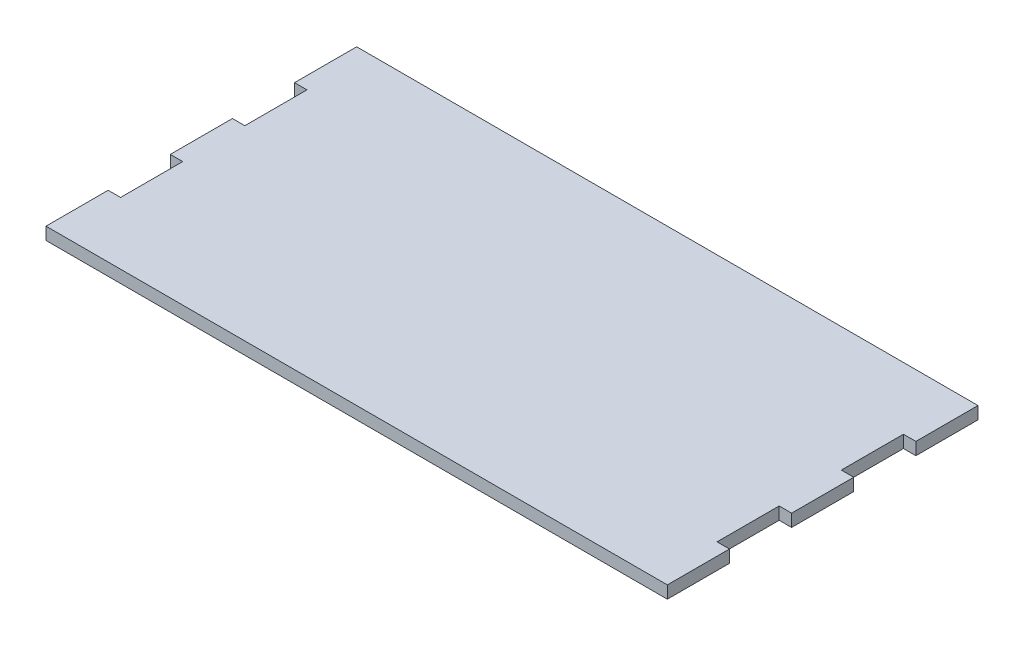
ISO-10303-21;
HEADER;
FILE_DESCRIPTION(('STEP AP214'),'2;1');
FILE_NAME('part.step','',(''),(''),'','','');
FILE_SCHEMA(('AUTOMOTIVE_DESIGN { 1 0 10303 214 1 1 1 1 }'));
ENDSEC;
DATA;
#1=APPLICATION_CONTEXT('core data for automotive mechanical design processes');
#2=APPLICATION_PROTOCOL_DEFINITION('international standard','automotive_design',2000,#1);
#3=PRODUCT_CONTEXT('',#1,'mechanical');
#4=PRODUCT('Part','Part','',(#3));
#5=PRODUCT_RELATED_PRODUCT_CATEGORY('part','',(#4));
#6=PRODUCT_DEFINITION_FORMATION('','',#4);
#7=PRODUCT_DEFINITION_CONTEXT('part definition',#1,'design');
#8=PRODUCT_DEFINITION('design','',#6,#7);
#9=PRODUCT_DEFINITION_SHAPE('','',#8);
#10=(LENGTH_UNIT() NAMED_UNIT(*) SI_UNIT(.MILLI.,.METRE.));
#11=(NAMED_UNIT(*) PLANE_ANGLE_UNIT() SI_UNIT($,.RADIAN.));
#12=(NAMED_UNIT(*) SI_UNIT($,.STERADIAN.) SOLID_ANGLE_UNIT());
#13=UNCERTAINTY_MEASURE_WITH_UNIT(LENGTH_MEASURE(1.E-05),#10,'distance_accuracy_value','');
#14=(GEOMETRIC_REPRESENTATION_CONTEXT(3) GLOBAL_UNCERTAINTY_ASSIGNED_CONTEXT((#13)) GLOBAL_UNIT_ASSIGNED_CONTEXT((#10,
#11,#12)) REPRESENTATION_CONTEXT('',''));
#15=CARTESIAN_POINT('',(0.,0.,0.));
#16=DIRECTION('',(0.,0.,1.));
#17=DIRECTION('',(1.,0.,0.));
#18=AXIS2_PLACEMENT_3D('',#15,#16,#17);
#19=CARTESIAN_POINT('',(250.,5.,0.));
#20=DIRECTION('',(-1.,0.,0.));
#21=DIRECTION('',(0.,0.,1.));
#22=AXIS2_PLACEMENT_3D('',#19,#20,#21);
#23=PLANE('',#22);
#24=DIRECTION('',(0.,0.,-1.));
#25=VECTOR('',#24,1.);
#26=CARTESIAN_POINT('',(250.,0.,0.));
#27=LINE('',#26,#25);
#28=CARTESIAN_POINT('',(250.,0.,-50.));
#29=VERTEX_POINT('',#28);
#30=CARTESIAN_POINT('',(250.,0.,-75.));
#31=VERTEX_POINT('',#30);
#32=EDGE_CURVE('E361',#29,#31,#27,.T.);
#33=ORIENTED_EDGE('',*,*,#32,.T.);
#34=DIRECTION('',(0.,1.,0.));
#35=VECTOR('',#34,1.);
#36=CARTESIAN_POINT('',(250.,0.,-75.));
#37=LINE('',#36,#35);
#38=CARTESIAN_POINT('',(250.,5.,-75.));
#39=VERTEX_POINT('',#38);
#40=EDGE_CURVE('E248',#31,#39,#37,.T.);
#41=ORIENTED_EDGE('',*,*,#40,.T.);
#42=DIRECTION('',(0.,0.,-1.));
#43=VECTOR('',#42,1.);
#44=CARTESIAN_POINT('',(250.,5.,0.));
#45=LINE('',#44,#43);
#46=CARTESIAN_POINT('',(250.,5.,-50.));
#47=VERTEX_POINT('',#46);
#48=EDGE_CURVE('E347',#47,#39,#45,.T.);
#49=ORIENTED_EDGE('',*,*,#48,.F.);
#50=DIRECTION('',(0.,1.,0.));
#51=VECTOR('',#50,1.);
#52=CARTESIAN_POINT('',(250.,0.,-50.));
#53=LINE('',#52,#51);
#54=EDGE_CURVE('E267',#29,#47,#53,.T.);
#55=ORIENTED_EDGE('',*,*,#54,.F.);
#56=EDGE_LOOP('',(#33,#41,#49,#55));
#57=FACE_BOUND('',#56,.T.);
#58=ADVANCED_FACE('F33',(#57),#23,.F.);
#59=CARTESIAN_POINT('',(250.,0.,0.));
#60=VERTEX_POINT('',#59);
#61=CARTESIAN_POINT('',(250.,0.,-25.));
#62=VERTEX_POINT('',#61);
#63=EDGE_CURVE('E357',#60,#62,#27,.T.);
#64=ORIENTED_EDGE('',*,*,#63,.T.);
#65=DIRECTION('',(0.,1.,0.));
#66=VECTOR('',#65,1.);
#67=CARTESIAN_POINT('',(250.,0.,-25.));
#68=LINE('',#67,#66);
#69=CARTESIAN_POINT('',(250.,5.,-25.));
#70=VERTEX_POINT('',#69);
#71=EDGE_CURVE('E274',#62,#70,#68,.T.);
#72=ORIENTED_EDGE('',*,*,#71,.T.);
#73=CARTESIAN_POINT('',(250.,5.,0.));
#74=VERTEX_POINT('',#73);
#75=EDGE_CURVE('E343',#74,#70,#45,.T.);
#76=ORIENTED_EDGE('',*,*,#75,.F.);
#77=DIRECTION('',(0.,-1.,0.));
#78=VECTOR('',#77,1.);
#79=CARTESIAN_POINT('',(250.,5.,0.));
#80=LINE('',#79,#78);
#81=EDGE_CURVE('E41',#74,#60,#80,.T.);
#82=ORIENTED_EDGE('',*,*,#81,.T.);
#83=EDGE_LOOP('',(#64,#72,#76,#82));
#84=FACE_BOUND('',#83,.T.);
#85=ADVANCED_FACE('F372',(#84),#23,.F.);
#86=CARTESIAN_POINT('',(0.,5.,0.));
#87=DIRECTION('',(1.,0.,0.));
#88=DIRECTION('',(0.,0.,-1.));
#89=AXIS2_PLACEMENT_3D('',#86,#87,#88);
#90=PLANE('',#89);
#91=DIRECTION('',(0.,0.,1.));
#92=VECTOR('',#91,1.);
#93=CARTESIAN_POINT('',(0.,0.,0.));
#94=LINE('',#93,#92);
#95=CARTESIAN_POINT('',(0.,0.,-75.));
#96=VERTEX_POINT('',#95);
#97=CARTESIAN_POINT('',(0.,0.,-50.));
#98=VERTEX_POINT('',#97);
#99=EDGE_CURVE('E354',#96,#98,#94,.T.);
#100=ORIENTED_EDGE('',*,*,#99,.T.);
#101=DIRECTION('',(0.,1.,0.));
#102=VECTOR('',#101,1.);
#103=CARTESIAN_POINT('',(0.,0.,-50.));
#104=LINE('',#103,#102);
#105=CARTESIAN_POINT('',(0.,5.,-50.));
#106=VERTEX_POINT('',#105);
#107=EDGE_CURVE('E300',#98,#106,#104,.T.);
#108=ORIENTED_EDGE('',*,*,#107,.T.);
#109=DIRECTION('',(0.,0.,1.));
#110=VECTOR('',#109,1.);
#111=CARTESIAN_POINT('',(0.,5.,0.));
#112=LINE('',#111,#110);
#113=CARTESIAN_POINT('',(0.,5.,-75.));
#114=VERTEX_POINT('',#113);
#115=EDGE_CURVE('E339',#114,#106,#112,.T.);
#116=ORIENTED_EDGE('',*,*,#115,.F.);
#117=DIRECTION('',(0.,1.,0.));
#118=VECTOR('',#117,1.);
#119=CARTESIAN_POINT('',(0.,0.,-75.));
#120=LINE('',#119,#118);
#121=EDGE_CURVE('E319',#96,#114,#120,.T.);
#122=ORIENTED_EDGE('',*,*,#121,.F.);
#123=EDGE_LOOP('',(#100,#108,#116,#122));
#124=FACE_BOUND('',#123,.T.);
#125=ADVANCED_FACE('F397',(#124),#90,.F.);
#126=CARTESIAN_POINT('',(0.,0.,-125.));
#127=VERTEX_POINT('',#126);
#128=CARTESIAN_POINT('',(0.,0.,-100.));
#129=VERTEX_POINT('',#128);
#130=EDGE_CURVE('E350',#127,#129,#94,.T.);
#131=ORIENTED_EDGE('',*,*,#130,.T.);
#132=DIRECTION('',(0.,1.,0.));
#133=VECTOR('',#132,1.);
#134=CARTESIAN_POINT('',(0.,0.,-100.));
#135=LINE('',#134,#133);
#136=CARTESIAN_POINT('',(0.,5.,-100.));
#137=VERTEX_POINT('',#136);
#138=EDGE_CURVE('E326',#129,#137,#135,.T.);
#139=ORIENTED_EDGE('',*,*,#138,.T.);
#140=CARTESIAN_POINT('',(0.,5.,-125.));
#141=VERTEX_POINT('',#140);
#142=EDGE_CURVE('E335',#141,#137,#112,.T.);
#143=ORIENTED_EDGE('',*,*,#142,.F.);
#144=DIRECTION('',(0.,-1.,0.));
#145=VECTOR('',#144,1.);
#146=CARTESIAN_POINT('',(0.,5.,-125.));
#147=LINE('',#146,#145);
#148=EDGE_CURVE('E349',#141,#127,#147,.T.);
#149=ORIENTED_EDGE('',*,*,#148,.T.);
#150=EDGE_LOOP('',(#131,#139,#143,#149));
#151=FACE_BOUND('',#150,.T.);
#152=ADVANCED_FACE('F418',(#151),#90,.F.);
#153=CARTESIAN_POINT('',(0.,5.,-25.));
#154=VERTEX_POINT('',#153);
#155=CARTESIAN_POINT('',(0.,5.,0.));
#156=VERTEX_POINT('',#155);
#157=EDGE_CURVE('E340',#154,#156,#112,.T.);
#158=ORIENTED_EDGE('',*,*,#157,.F.);
#159=DIRECTION('',(0.,1.,0.));
#160=VECTOR('',#159,1.);
#161=CARTESIAN_POINT('',(0.,0.,-25.));
#162=LINE('',#161,#160);
#163=CARTESIAN_POINT('',(0.,0.,-25.));
#164=VERTEX_POINT('',#163);
#165=EDGE_CURVE('E293',#164,#154,#162,.T.);
#166=ORIENTED_EDGE('',*,*,#165,.F.);
#167=CARTESIAN_POINT('',(0.,0.,0.));
#168=VERTEX_POINT('',#167);
#169=EDGE_CURVE('E329',#164,#168,#94,.T.);
#170=ORIENTED_EDGE('',*,*,#169,.T.);
#171=DIRECTION('',(0.,-1.,0.));
#172=VECTOR('',#171,1.);
#173=CARTESIAN_POINT('',(0.,5.,0.));
#174=LINE('',#173,#172);
#175=EDGE_CURVE('E11',#156,#168,#174,.T.);
#176=ORIENTED_EDGE('',*,*,#175,.F.);
#177=EDGE_LOOP('',(#158,#166,#170,#176));
#178=FACE_BOUND('',#177,.T.);
#179=ADVANCED_FACE('F35',(#178),#90,.F.);
#180=CARTESIAN_POINT('',(0.,5.,0.));
#181=DIRECTION('',(0.,0.,-1.));
#182=DIRECTION('',(-1.,0.,0.));
#183=AXIS2_PLACEMENT_3D('',#180,#181,#182);
#184=PLANE('',#183);
#185=DIRECTION('',(1.,0.,0.));
#186=VECTOR('',#185,1.);
#187=CARTESIAN_POINT('',(0.,0.,0.));
#188=LINE('',#187,#186);
#189=EDGE_CURVE('E353',#168,#60,#188,.T.);
#190=ORIENTED_EDGE('',*,*,#189,.T.);
#191=ORIENTED_EDGE('',*,*,#81,.F.);
#192=DIRECTION('',(1.,0.,0.));
#193=VECTOR('',#192,1.);
#194=CARTESIAN_POINT('',(0.,5.,0.));
#195=LINE('',#194,#193);
#196=EDGE_CURVE('E338',#156,#74,#195,.T.);
#197=ORIENTED_EDGE('',*,*,#196,.F.);
#198=ORIENTED_EDGE('',*,*,#175,.T.);
#199=EDGE_LOOP('',(#190,#191,#197,#198));
#200=FACE_BOUND('',#199,.T.);
#201=ADVANCED_FACE('F390',(#200),#184,.F.);
#202=CARTESIAN_POINT('',(250.,5.,-100.));
#203=VERTEX_POINT('',#202);
#204=CARTESIAN_POINT('',(250.,5.,-125.));
#205=VERTEX_POINT('',#204);
#206=EDGE_CURVE('E342',#203,#205,#45,.T.);
#207=ORIENTED_EDGE('',*,*,#206,.F.);
#208=DIRECTION('',(0.,1.,0.));
#209=VECTOR('',#208,1.);
#210=CARTESIAN_POINT('',(250.,0.,-100.));
#211=LINE('',#210,#209);
#212=CARTESIAN_POINT('',(250.,0.,-100.));
#213=VERTEX_POINT('',#212);
#214=EDGE_CURVE('E241',#213,#203,#211,.T.);
#215=ORIENTED_EDGE('',*,*,#214,.F.);
#216=CARTESIAN_POINT('',(250.,0.,-125.));
#217=VERTEX_POINT('',#216);
#218=EDGE_CURVE('E356',#213,#217,#27,.T.);
#219=ORIENTED_EDGE('',*,*,#218,.T.);
#220=DIRECTION('',(0.,-1.,0.));
#221=VECTOR('',#220,1.);
#222=CARTESIAN_POINT('',(250.,5.,-125.));
#223=LINE('',#222,#221);
#224=EDGE_CURVE('E365',#205,#217,#223,.T.);
#225=ORIENTED_EDGE('',*,*,#224,.F.);
#226=EDGE_LOOP('',(#207,#215,#219,#225));
#227=FACE_BOUND('',#226,.T.);
#228=ADVANCED_FACE('F441',(#227),#23,.F.);
#229=CARTESIAN_POINT('',(0.,5.,-125.));
#230=DIRECTION('',(0.,0.,1.));
#231=DIRECTION('',(1.,0.,0.));
#232=AXIS2_PLACEMENT_3D('',#229,#230,#231);
#233=PLANE('',#232);
#234=DIRECTION('',(-1.,0.,0.));
#235=VECTOR('',#234,1.);
#236=CARTESIAN_POINT('',(0.,0.,-125.));
#237=LINE('',#236,#235);
#238=EDGE_CURVE('E360',#217,#127,#237,.T.);
#239=ORIENTED_EDGE('',*,*,#238,.T.);
#240=ORIENTED_EDGE('',*,*,#148,.F.);
#241=DIRECTION('',(-1.,0.,0.));
#242=VECTOR('',#241,1.);
#243=CARTESIAN_POINT('',(0.,5.,-125.));
#244=LINE('',#243,#242);
#245=EDGE_CURVE('E346',#205,#141,#244,.T.);
#246=ORIENTED_EDGE('',*,*,#245,.F.);
#247=ORIENTED_EDGE('',*,*,#224,.T.);
#248=EDGE_LOOP('',(#239,#240,#246,#247));
#249=FACE_BOUND('',#248,.T.);
#250=ADVANCED_FACE('F423',(#249),#233,.F.);
#251=CARTESIAN_POINT('',(0.,5.,0.));
#252=DIRECTION('',(0.,-1.,0.));
#253=DIRECTION('',(0.,0.,-1.));
#254=AXIS2_PLACEMENT_3D('',#251,#252,#253);
#255=PLANE('',#254);
#256=ORIENTED_EDGE('',*,*,#48,.T.);
#257=DIRECTION('',(1.,0.,0.));
#258=VECTOR('',#257,1.);
#259=CARTESIAN_POINT('',(250.,5.,-75.));
#260=LINE('',#259,#258);
#261=CARTESIAN_POINT('',(245.,5.,-75.));
#262=VERTEX_POINT('',#261);
#263=EDGE_CURVE('E236',#262,#39,#260,.T.);
#264=ORIENTED_EDGE('',*,*,#263,.F.);
#265=DIRECTION('',(0.,0.,1.));
#266=VECTOR('',#265,1.);
#267=CARTESIAN_POINT('',(245.,5.,-100.));
#268=LINE('',#267,#266);
#269=CARTESIAN_POINT('',(245.,5.,-100.));
#270=VERTEX_POINT('',#269);
#271=EDGE_CURVE('E244',#270,#262,#268,.T.);
#272=ORIENTED_EDGE('',*,*,#271,.F.);
#273=DIRECTION('',(-1.,0.,0.));
#274=VECTOR('',#273,1.);
#275=CARTESIAN_POINT('',(250.,5.,-100.));
#276=LINE('',#275,#274);
#277=EDGE_CURVE('E229',#203,#270,#276,.T.);
#278=ORIENTED_EDGE('',*,*,#277,.F.);
#279=ORIENTED_EDGE('',*,*,#206,.T.);
#280=ORIENTED_EDGE('',*,*,#245,.T.);
#281=ORIENTED_EDGE('',*,*,#142,.T.);
#282=DIRECTION('',(-1.,0.,0.));
#283=VECTOR('',#282,1.);
#284=CARTESIAN_POINT('',(0.,5.,-100.));
#285=LINE('',#284,#283);
#286=CARTESIAN_POINT('',(5.,5.,-100.));
#287=VERTEX_POINT('',#286);
#288=EDGE_CURVE('E313',#287,#137,#285,.T.);
#289=ORIENTED_EDGE('',*,*,#288,.F.);
#290=DIRECTION('',(0.,0.,-1.));
#291=VECTOR('',#290,1.);
#292=CARTESIAN_POINT('',(5.,5.,-100.));
#293=LINE('',#292,#291);
#294=CARTESIAN_POINT('',(5.,5.,-75.));
#295=VERTEX_POINT('',#294);
#296=EDGE_CURVE('E322',#295,#287,#293,.T.);
#297=ORIENTED_EDGE('',*,*,#296,.F.);
#298=DIRECTION('',(1.,0.,0.));
#299=VECTOR('',#298,1.);
#300=CARTESIAN_POINT('',(0.,5.,-75.));
#301=LINE('',#300,#299);
#302=EDGE_CURVE('E303',#114,#295,#301,.T.);
#303=ORIENTED_EDGE('',*,*,#302,.F.);
#304=ORIENTED_EDGE('',*,*,#115,.T.);
#305=DIRECTION('',(-1.,0.,0.));
#306=VECTOR('',#305,1.);
#307=CARTESIAN_POINT('',(0.,5.,-50.));
#308=LINE('',#307,#306);
#309=CARTESIAN_POINT('',(4.99999999999999,5.,-50.));
#310=VERTEX_POINT('',#309);
#311=EDGE_CURVE('E287',#310,#106,#308,.T.);
#312=ORIENTED_EDGE('',*,*,#311,.F.);
#313=DIRECTION('',(0.,0.,-1.));
#314=VECTOR('',#313,1.);
#315=CARTESIAN_POINT('',(4.99999999999999,5.,-50.));
#316=LINE('',#315,#314);
#317=CARTESIAN_POINT('',(4.99999999999999,5.,-25.));
#318=VERTEX_POINT('',#317);
#319=EDGE_CURVE('E296',#318,#310,#316,.T.);
#320=ORIENTED_EDGE('',*,*,#319,.F.);
#321=DIRECTION('',(1.,0.,0.));
#322=VECTOR('',#321,1.);
#323=CARTESIAN_POINT('',(0.,5.,-25.));
#324=LINE('',#323,#322);
#325=EDGE_CURVE('E277',#154,#318,#324,.T.);
#326=ORIENTED_EDGE('',*,*,#325,.F.);
#327=ORIENTED_EDGE('',*,*,#157,.T.);
#328=ORIENTED_EDGE('',*,*,#196,.T.);
#329=ORIENTED_EDGE('',*,*,#75,.T.);
#330=DIRECTION('',(1.,0.,0.));
#331=VECTOR('',#330,1.);
#332=CARTESIAN_POINT('',(250.,5.,-25.));
#333=LINE('',#332,#331);
#334=CARTESIAN_POINT('',(245.,5.,-25.));
#335=VERTEX_POINT('',#334);
#336=EDGE_CURVE('E261',#335,#70,#333,.T.);
#337=ORIENTED_EDGE('',*,*,#336,.F.);
#338=DIRECTION('',(0.,0.,1.));
#339=VECTOR('',#338,1.);
#340=CARTESIAN_POINT('',(245.,5.,-50.));
#341=LINE('',#340,#339);
#342=CARTESIAN_POINT('',(245.,5.,-50.));
#343=VERTEX_POINT('',#342);
#344=EDGE_CURVE('E270',#343,#335,#341,.T.);
#345=ORIENTED_EDGE('',*,*,#344,.F.);
#346=DIRECTION('',(-1.,0.,0.));
#347=VECTOR('',#346,1.);
#348=CARTESIAN_POINT('',(250.,5.,-50.));
#349=LINE('',#348,#347);
#350=EDGE_CURVE('E251',#47,#343,#349,.T.);
#351=ORIENTED_EDGE('',*,*,#350,.F.);
#352=EDGE_LOOP('',(#256,#264,#272,#278,#279,#280,#281,#289,#297,#303,#304,#312,#320,#326,#327,
#328,#329,#337,#345,#351));
#353=FACE_BOUND('',#352,.T.);
#354=ADVANCED_FACE('F385',(#353),#255,.F.);
#355=CARTESIAN_POINT('',(0.,0.,0.));
#356=DIRECTION('',(0.,-1.,0.));
#357=DIRECTION('',(0.,0.,-1.));
#358=AXIS2_PLACEMENT_3D('',#355,#356,#357);
#359=PLANE('',#358);
#360=DIRECTION('',(0.,0.,-1.));
#361=VECTOR('',#360,1.);
#362=CARTESIAN_POINT('',(4.99999999999999,0.,-10.));
#363=LINE('',#362,#361);
#364=CARTESIAN_POINT('',(4.99999999999999,0.,-10.));
#365=VERTEX_POINT('',#364);
#366=CARTESIAN_POINT('',(4.99999999999999,0.,-15.));
#367=VERTEX_POINT('',#366);
#368=EDGE_CURVE('E48',#365,#367,#363,.T.);
#369=ORIENTED_EDGE('',*,*,#368,.F.);
#370=DIRECTION('',(-1.,0.,0.));
#371=VECTOR('',#370,1.);
#372=CARTESIAN_POINT('',(4.99999999999999,0.,-10.));
#373=LINE('',#372,#371);
#374=CARTESIAN_POINT('',(245.,0.,-10.));
#375=VERTEX_POINT('',#374);
#376=EDGE_CURVE('E214',#375,#365,#373,.T.);
#377=ORIENTED_EDGE('',*,*,#376,.F.);
#378=DIRECTION('',(0.,0.,1.));
#379=VECTOR('',#378,1.);
#380=CARTESIAN_POINT('',(245.,0.,-10.));
#381=LINE('',#380,#379);
#382=CARTESIAN_POINT('',(245.,0.,-15.));
#383=VERTEX_POINT('',#382);
#384=EDGE_CURVE('E217',#383,#375,#381,.T.);
#385=ORIENTED_EDGE('',*,*,#384,.F.);
#386=DIRECTION('',(1.,0.,0.));
#387=VECTOR('',#386,1.);
#388=CARTESIAN_POINT('',(4.99999999999999,0.,-15.));
#389=LINE('',#388,#387);
#390=EDGE_CURVE('E223',#367,#383,#389,.T.);
#391=ORIENTED_EDGE('',*,*,#390,.F.);
#392=EDGE_LOOP('',(#369,#377,#385,#391));
#393=FACE_BOUND('',#392,.T.);
#394=DIRECTION('',(1.,0.,0.));
#395=VECTOR('',#394,1.);
#396=CARTESIAN_POINT('',(250.,0.,-75.));
#397=LINE('',#396,#395);
#398=CARTESIAN_POINT('',(245.,0.,-75.));
#399=VERTEX_POINT('',#398);
#400=EDGE_CURVE('E238',#399,#31,#397,.T.);
#401=ORIENTED_EDGE('',*,*,#400,.T.);
#402=ORIENTED_EDGE('',*,*,#32,.F.);
#403=DIRECTION('',(-1.,0.,0.));
#404=VECTOR('',#403,1.);
#405=CARTESIAN_POINT('',(250.,0.,-50.));
#406=LINE('',#405,#404);
#407=CARTESIAN_POINT('',(245.,0.,-50.));
#408=VERTEX_POINT('',#407);
#409=EDGE_CURVE('E257',#29,#408,#406,.T.);
#410=ORIENTED_EDGE('',*,*,#409,.T.);
#411=DIRECTION('',(0.,0.,1.));
#412=VECTOR('',#411,1.);
#413=CARTESIAN_POINT('',(245.,0.,-50.));
#414=LINE('',#413,#412);
#415=CARTESIAN_POINT('',(245.,0.,-25.));
#416=VERTEX_POINT('',#415);
#417=EDGE_CURVE('E260',#408,#416,#414,.T.);
#418=ORIENTED_EDGE('',*,*,#417,.T.);
#419=DIRECTION('',(1.,0.,0.));
#420=VECTOR('',#419,1.);
#421=CARTESIAN_POINT('',(250.,0.,-25.));
#422=LINE('',#421,#420);
#423=EDGE_CURVE('E264',#416,#62,#422,.T.);
#424=ORIENTED_EDGE('',*,*,#423,.T.);
#425=ORIENTED_EDGE('',*,*,#63,.F.);
#426=ORIENTED_EDGE('',*,*,#189,.F.);
#427=ORIENTED_EDGE('',*,*,#169,.F.);
#428=DIRECTION('',(1.,0.,0.));
#429=VECTOR('',#428,1.);
#430=CARTESIAN_POINT('',(0.,0.,-25.));
#431=LINE('',#430,#429);
#432=CARTESIAN_POINT('',(4.99999999999999,0.,-25.));
#433=VERTEX_POINT('',#432);
#434=EDGE_CURVE('E283',#164,#433,#431,.T.);
#435=ORIENTED_EDGE('',*,*,#434,.T.);
#436=DIRECTION('',(0.,0.,-1.));
#437=VECTOR('',#436,1.);
#438=CARTESIAN_POINT('',(4.99999999999999,0.,-50.));
#439=LINE('',#438,#437);
#440=CARTESIAN_POINT('',(4.99999999999999,0.,-50.));
#441=VERTEX_POINT('',#440);
#442=EDGE_CURVE('E286',#433,#441,#439,.T.);
#443=ORIENTED_EDGE('',*,*,#442,.T.);
#444=DIRECTION('',(-1.,0.,0.));
#445=VECTOR('',#444,1.);
#446=CARTESIAN_POINT('',(0.,0.,-50.));
#447=LINE('',#446,#445);
#448=EDGE_CURVE('E290',#441,#98,#447,.T.);
#449=ORIENTED_EDGE('',*,*,#448,.T.);
#450=ORIENTED_EDGE('',*,*,#99,.F.);
#451=DIRECTION('',(1.,0.,0.));
#452=VECTOR('',#451,1.);
#453=CARTESIAN_POINT('',(0.,0.,-75.));
#454=LINE('',#453,#452);
#455=CARTESIAN_POINT('',(5.,0.,-75.));
#456=VERTEX_POINT('',#455);
#457=EDGE_CURVE('E309',#96,#456,#454,.T.);
#458=ORIENTED_EDGE('',*,*,#457,.T.);
#459=DIRECTION('',(0.,0.,-1.));
#460=VECTOR('',#459,1.);
#461=CARTESIAN_POINT('',(5.,0.,-100.));
#462=LINE('',#461,#460);
#463=CARTESIAN_POINT('',(5.,0.,-100.));
#464=VERTEX_POINT('',#463);
#465=EDGE_CURVE('E312',#456,#464,#462,.T.);
#466=ORIENTED_EDGE('',*,*,#465,.T.);
#467=DIRECTION('',(-1.,0.,0.));
#468=VECTOR('',#467,1.);
#469=CARTESIAN_POINT('',(0.,0.,-100.));
#470=LINE('',#469,#468);
#471=EDGE_CURVE('E316',#464,#129,#470,.T.);
#472=ORIENTED_EDGE('',*,*,#471,.T.);
#473=ORIENTED_EDGE('',*,*,#130,.F.);
#474=ORIENTED_EDGE('',*,*,#238,.F.);
#475=ORIENTED_EDGE('',*,*,#218,.F.);
#476=DIRECTION('',(-1.,0.,0.));
#477=VECTOR('',#476,1.);
#478=CARTESIAN_POINT('',(250.,0.,-100.));
#479=LINE('',#478,#477);
#480=CARTESIAN_POINT('',(245.,0.,-100.));
#481=VERTEX_POINT('',#480);
#482=EDGE_CURVE('E233',#213,#481,#479,.T.);
#483=ORIENTED_EDGE('',*,*,#482,.T.);
#484=DIRECTION('',(0.,0.,1.));
#485=VECTOR('',#484,1.);
#486=CARTESIAN_POINT('',(245.,0.,-100.));
#487=LINE('',#486,#485);
#488=EDGE_CURVE('E56',#481,#399,#487,.T.);
#489=ORIENTED_EDGE('',*,*,#488,.T.);
#490=EDGE_LOOP('',(#401,#402,#410,#418,#424,#425,#426,#427,#435,#443,#449,#450,#458,#466,#472,
#473,#474,#475,#483,#489));
#491=FACE_BOUND('',#490,.T.);
#492=ADVANCED_FACE('F377',(#393,#491),#359,.T.);
#493=CARTESIAN_POINT('',(0.,0.,-100.));
#494=DIRECTION('',(0.,0.,-1.));
#495=DIRECTION('',(-1.,0.,0.));
#496=AXIS2_PLACEMENT_3D('',#493,#494,#495);
#497=PLANE('',#496);
#498=ORIENTED_EDGE('',*,*,#288,.T.);
#499=ORIENTED_EDGE('',*,*,#138,.F.);
#500=ORIENTED_EDGE('',*,*,#471,.F.);
#501=DIRECTION('',(0.,1.,0.));
#502=VECTOR('',#501,1.);
#503=CARTESIAN_POINT('',(5.,0.,-100.));
#504=LINE('',#503,#502);
#505=EDGE_CURVE('E330',#464,#287,#504,.T.);
#506=ORIENTED_EDGE('',*,*,#505,.T.);
#507=EDGE_LOOP('',(#498,#499,#500,#506));
#508=FACE_BOUND('',#507,.T.);
#509=ADVANCED_FACE('F503',(#508),#497,.F.);
#510=CARTESIAN_POINT('',(5.,0.,-100.));
#511=DIRECTION('',(1.,0.,0.));
#512=DIRECTION('',(0.,0.,-1.));
#513=AXIS2_PLACEMENT_3D('',#510,#511,#512);
#514=PLANE('',#513);
#515=ORIENTED_EDGE('',*,*,#296,.T.);
#516=ORIENTED_EDGE('',*,*,#505,.F.);
#517=ORIENTED_EDGE('',*,*,#465,.F.);
#518=DIRECTION('',(0.,1.,0.));
#519=VECTOR('',#518,1.);
#520=CARTESIAN_POINT('',(5.,0.,-75.));
#521=LINE('',#520,#519);
#522=EDGE_CURVE('E332',#456,#295,#521,.T.);
#523=ORIENTED_EDGE('',*,*,#522,.T.);
#524=EDGE_LOOP('',(#515,#516,#517,#523));
#525=FACE_BOUND('',#524,.T.);
#526=ADVANCED_FACE('F412',(#525),#514,.F.);
#527=CARTESIAN_POINT('',(0.,0.,-75.));
#528=DIRECTION('',(0.,0.,1.));
#529=DIRECTION('',(1.,0.,0.));
#530=AXIS2_PLACEMENT_3D('',#527,#528,#529);
#531=PLANE('',#530);
#532=ORIENTED_EDGE('',*,*,#302,.T.);
#533=ORIENTED_EDGE('',*,*,#522,.F.);
#534=ORIENTED_EDGE('',*,*,#457,.F.);
#535=ORIENTED_EDGE('',*,*,#121,.T.);
#536=EDGE_LOOP('',(#532,#533,#534,#535));
#537=FACE_BOUND('',#536,.T.);
#538=ADVANCED_FACE('F410',(#537),#531,.F.);
#539=CARTESIAN_POINT('',(0.,0.,-50.));
#540=DIRECTION('',(0.,0.,-1.));
#541=DIRECTION('',(-1.,0.,0.));
#542=AXIS2_PLACEMENT_3D('',#539,#540,#541);
#543=PLANE('',#542);
#544=ORIENTED_EDGE('',*,*,#311,.T.);
#545=ORIENTED_EDGE('',*,*,#107,.F.);
#546=ORIENTED_EDGE('',*,*,#448,.F.);
#547=DIRECTION('',(0.,1.,0.));
#548=VECTOR('',#547,1.);
#549=CARTESIAN_POINT('',(4.99999999999999,0.,-50.));
#550=LINE('',#549,#548);
#551=EDGE_CURVE('E304',#441,#310,#550,.T.);
#552=ORIENTED_EDGE('',*,*,#551,.T.);
#553=EDGE_LOOP('',(#544,#545,#546,#552));
#554=FACE_BOUND('',#553,.T.);
#555=ADVANCED_FACE('F402',(#554),#543,.F.);
#556=CARTESIAN_POINT('',(4.99999999999999,0.,-50.));
#557=DIRECTION('',(1.,0.,0.));
#558=DIRECTION('',(0.,0.,-1.));
#559=AXIS2_PLACEMENT_3D('',#556,#557,#558);
#560=PLANE('',#559);
#561=ORIENTED_EDGE('',*,*,#319,.T.);
#562=ORIENTED_EDGE('',*,*,#551,.F.);
#563=ORIENTED_EDGE('',*,*,#442,.F.);
#564=DIRECTION('',(0.,1.,0.));
#565=VECTOR('',#564,1.);
#566=CARTESIAN_POINT('',(4.99999999999999,0.,-25.));
#567=LINE('',#566,#565);
#568=EDGE_CURVE('E306',#433,#318,#567,.T.);
#569=ORIENTED_EDGE('',*,*,#568,.T.);
#570=EDGE_LOOP('',(#561,#562,#563,#569));
#571=FACE_BOUND('',#570,.T.);
#572=ADVANCED_FACE('F544',(#571),#560,.F.);
#573=CARTESIAN_POINT('',(0.,0.,-25.));
#574=DIRECTION('',(0.,0.,1.));
#575=DIRECTION('',(1.,0.,0.));
#576=AXIS2_PLACEMENT_3D('',#573,#574,#575);
#577=PLANE('',#576);
#578=ORIENTED_EDGE('',*,*,#325,.T.);
#579=ORIENTED_EDGE('',*,*,#568,.F.);
#580=ORIENTED_EDGE('',*,*,#434,.F.);
#581=ORIENTED_EDGE('',*,*,#165,.T.);
#582=EDGE_LOOP('',(#578,#579,#580,#581));
#583=FACE_BOUND('',#582,.T.);
#584=ADVANCED_FACE('F553',(#583),#577,.F.);
#585=CARTESIAN_POINT('',(250.,0.,-25.));
#586=DIRECTION('',(0.,0.,1.));
#587=DIRECTION('',(1.,0.,0.));
#588=AXIS2_PLACEMENT_3D('',#585,#586,#587);
#589=PLANE('',#588);
#590=ORIENTED_EDGE('',*,*,#336,.T.);
#591=ORIENTED_EDGE('',*,*,#71,.F.);
#592=ORIENTED_EDGE('',*,*,#423,.F.);
#593=DIRECTION('',(0.,1.,0.));
#594=VECTOR('',#593,1.);
#595=CARTESIAN_POINT('',(245.,0.,-25.));
#596=LINE('',#595,#594);
#597=EDGE_CURVE('E278',#416,#335,#596,.T.);
#598=ORIENTED_EDGE('',*,*,#597,.T.);
#599=EDGE_LOOP('',(#590,#591,#592,#598));
#600=FACE_BOUND('',#599,.T.);
#601=ADVANCED_FACE('F381',(#600),#589,.F.);
#602=CARTESIAN_POINT('',(245.,0.,-50.));
#603=DIRECTION('',(-1.,0.,0.));
#604=DIRECTION('',(0.,0.,1.));
#605=AXIS2_PLACEMENT_3D('',#602,#603,#604);
#606=PLANE('',#605);
#607=ORIENTED_EDGE('',*,*,#344,.T.);
#608=ORIENTED_EDGE('',*,*,#597,.F.);
#609=ORIENTED_EDGE('',*,*,#417,.F.);
#610=DIRECTION('',(0.,1.,0.));
#611=VECTOR('',#610,1.);
#612=CARTESIAN_POINT('',(245.,0.,-50.));
#613=LINE('',#612,#611);
#614=EDGE_CURVE('E280',#408,#343,#613,.T.);
#615=ORIENTED_EDGE('',*,*,#614,.T.);
#616=EDGE_LOOP('',(#607,#608,#609,#615));
#617=FACE_BOUND('',#616,.T.);
#618=ADVANCED_FACE('F572',(#617),#606,.F.);
#619=CARTESIAN_POINT('',(250.,0.,-50.));
#620=DIRECTION('',(0.,0.,-1.));
#621=DIRECTION('',(-1.,0.,0.));
#622=AXIS2_PLACEMENT_3D('',#619,#620,#621);
#623=PLANE('',#622);
#624=ORIENTED_EDGE('',*,*,#350,.T.);
#625=ORIENTED_EDGE('',*,*,#614,.F.);
#626=ORIENTED_EDGE('',*,*,#409,.F.);
#627=ORIENTED_EDGE('',*,*,#54,.T.);
#628=EDGE_LOOP('',(#624,#625,#626,#627));
#629=FACE_BOUND('',#628,.T.);
#630=ADVANCED_FACE('F581',(#629),#623,.F.);
#631=CARTESIAN_POINT('',(250.,0.,-75.));
#632=DIRECTION('',(0.,0.,1.));
#633=DIRECTION('',(1.,0.,0.));
#634=AXIS2_PLACEMENT_3D('',#631,#632,#633);
#635=PLANE('',#634);
#636=ORIENTED_EDGE('',*,*,#263,.T.);
#637=ORIENTED_EDGE('',*,*,#40,.F.);
#638=ORIENTED_EDGE('',*,*,#400,.F.);
#639=DIRECTION('',(0.,1.,0.));
#640=VECTOR('',#639,1.);
#641=CARTESIAN_POINT('',(245.,0.,-75.));
#642=LINE('',#641,#640);
#643=EDGE_CURVE('E252',#399,#262,#642,.T.);
#644=ORIENTED_EDGE('',*,*,#643,.T.);
#645=EDGE_LOOP('',(#636,#637,#638,#644));
#646=FACE_BOUND('',#645,.T.);
#647=ADVANCED_FACE('F435',(#646),#635,.F.);
#648=CARTESIAN_POINT('',(245.,0.,-100.));
#649=DIRECTION('',(-1.,0.,0.));
#650=DIRECTION('',(0.,0.,1.));
#651=AXIS2_PLACEMENT_3D('',#648,#649,#650);
#652=PLANE('',#651);
#653=ORIENTED_EDGE('',*,*,#271,.T.);
#654=ORIENTED_EDGE('',*,*,#643,.F.);
#655=ORIENTED_EDGE('',*,*,#488,.F.);
#656=DIRECTION('',(0.,1.,0.));
#657=VECTOR('',#656,1.);
#658=CARTESIAN_POINT('',(245.,0.,-100.));
#659=LINE('',#658,#657);
#660=EDGE_CURVE('E254',#481,#270,#659,.T.);
#661=ORIENTED_EDGE('',*,*,#660,.T.);
#662=EDGE_LOOP('',(#653,#654,#655,#661));
#663=FACE_BOUND('',#662,.T.);
#664=ADVANCED_FACE('F600',(#663),#652,.F.);
#665=CARTESIAN_POINT('',(250.,0.,-100.));
#666=DIRECTION('',(0.,0.,-1.));
#667=DIRECTION('',(-1.,0.,0.));
#668=AXIS2_PLACEMENT_3D('',#665,#666,#667);
#669=PLANE('',#668);
#670=ORIENTED_EDGE('',*,*,#277,.T.);
#671=ORIENTED_EDGE('',*,*,#660,.F.);
#672=ORIENTED_EDGE('',*,*,#482,.F.);
#673=ORIENTED_EDGE('',*,*,#214,.T.);
#674=EDGE_LOOP('',(#670,#671,#672,#673));
#675=FACE_BOUND('',#674,.T.);
#676=ADVANCED_FACE('F608',(#675),#669,.F.);
#677=CARTESIAN_POINT('',(4.99999999999999,2.5,-10.));
#678=DIRECTION('',(-1.,0.,0.));
#679=DIRECTION('',(0.,0.,1.));
#680=AXIS2_PLACEMENT_3D('',#677,#678,#679);
#681=PLANE('',#680);
#682=ORIENTED_EDGE('',*,*,#368,.T.);
#683=DIRECTION('',(0.,-1.,0.));
#684=VECTOR('',#683,1.);
#685=CARTESIAN_POINT('',(4.99999999999999,2.5,-15.));
#686=LINE('',#685,#684);
#687=CARTESIAN_POINT('',(4.99999999999999,2.5,-15.));
#688=VERTEX_POINT('',#687);
#689=EDGE_CURVE('E192',#688,#367,#686,.T.);
#690=ORIENTED_EDGE('',*,*,#689,.F.);
#691=DIRECTION('',(0.,0.,-1.));
#692=VECTOR('',#691,1.);
#693=CARTESIAN_POINT('',(4.99999999999999,2.5,-10.));
#694=LINE('',#693,#692);
#695=CARTESIAN_POINT('',(4.99999999999999,2.5,-10.));
#696=VERTEX_POINT('',#695);
#697=EDGE_CURVE('E196',#696,#688,#694,.T.);
#698=ORIENTED_EDGE('',*,*,#697,.F.);
#699=DIRECTION('',(0.,-1.,0.));
#700=VECTOR('',#699,1.);
#701=CARTESIAN_POINT('',(4.99999999999999,2.5,-10.));
#702=LINE('',#701,#700);
#703=EDGE_CURVE('E227',#696,#365,#702,.T.);
#704=ORIENTED_EDGE('',*,*,#703,.T.);
#705=EDGE_LOOP('',(#682,#690,#698,#704));
#706=FACE_BOUND('',#705,.T.);
#707=ADVANCED_FACE('F194',(#706),#681,.F.);
#708=CARTESIAN_POINT('',(4.99999999999999,2.5,-10.));
#709=DIRECTION('',(0.,0.,1.));
#710=DIRECTION('',(1.,0.,0.));
#711=AXIS2_PLACEMENT_3D('',#708,#709,#710);
#712=PLANE('',#711);
#713=ORIENTED_EDGE('',*,*,#376,.T.);
#714=ORIENTED_EDGE('',*,*,#703,.F.);
#715=DIRECTION('',(-1.,0.,0.));
#716=VECTOR('',#715,1.);
#717=CARTESIAN_POINT('',(4.99999999999999,2.5,-10.));
#718=LINE('',#717,#716);
#719=CARTESIAN_POINT('',(245.,2.5,-10.));
#720=VERTEX_POINT('',#719);
#721=EDGE_CURVE('E202',#720,#696,#718,.T.);
#722=ORIENTED_EDGE('',*,*,#721,.F.);
#723=DIRECTION('',(0.,-1.,0.));
#724=VECTOR('',#723,1.);
#725=CARTESIAN_POINT('',(245.,2.5,-10.));
#726=LINE('',#725,#724);
#727=EDGE_CURVE('E230',#720,#375,#726,.T.);
#728=ORIENTED_EDGE('',*,*,#727,.T.);
#729=EDGE_LOOP('',(#713,#714,#722,#728));
#730=FACE_BOUND('',#729,.T.);
#731=ADVANCED_FACE('F625',(#730),#712,.F.);
#732=CARTESIAN_POINT('',(245.,2.5,-10.));
#733=DIRECTION('',(1.,0.,0.));
#734=DIRECTION('',(0.,0.,-1.));
#735=AXIS2_PLACEMENT_3D('',#732,#733,#734);
#736=PLANE('',#735);
#737=ORIENTED_EDGE('',*,*,#384,.T.);
#738=ORIENTED_EDGE('',*,*,#727,.F.);
#739=DIRECTION('',(0.,0.,1.));
#740=VECTOR('',#739,1.);
#741=CARTESIAN_POINT('',(245.,2.5,-10.));
#742=LINE('',#741,#740);
#743=CARTESIAN_POINT('',(245.,2.5,-15.));
#744=VERTEX_POINT('',#743);
#745=EDGE_CURVE('E210',#744,#720,#742,.T.);
#746=ORIENTED_EDGE('',*,*,#745,.F.);
#747=DIRECTION('',(0.,-1.,0.));
#748=VECTOR('',#747,1.);
#749=CARTESIAN_POINT('',(245.,2.5,-15.));
#750=LINE('',#749,#748);
#751=EDGE_CURVE('E201',#744,#383,#750,.T.);
#752=ORIENTED_EDGE('',*,*,#751,.T.);
#753=EDGE_LOOP('',(#737,#738,#746,#752));
#754=FACE_BOUND('',#753,.T.);
#755=ADVANCED_FACE('F631',(#754),#736,.F.);
#756=CARTESIAN_POINT('',(4.99999999999999,2.5,-15.));
#757=DIRECTION('',(0.,0.,-1.));
#758=DIRECTION('',(-1.,0.,0.));
#759=AXIS2_PLACEMENT_3D('',#756,#757,#758);
#760=PLANE('',#759);
#761=ORIENTED_EDGE('',*,*,#390,.T.);
#762=ORIENTED_EDGE('',*,*,#751,.F.);
#763=DIRECTION('',(1.,0.,0.));
#764=VECTOR('',#763,1.);
#765=CARTESIAN_POINT('',(4.99999999999999,2.5,-15.));
#766=LINE('',#765,#764);
#767=EDGE_CURVE('E205',#688,#744,#766,.T.);
#768=ORIENTED_EDGE('',*,*,#767,.F.);
#769=ORIENTED_EDGE('',*,*,#689,.T.);
#770=EDGE_LOOP('',(#761,#762,#768,#769));
#771=FACE_BOUND('',#770,.T.);
#772=ADVANCED_FACE('F206',(#771),#760,.F.);
#773=CARTESIAN_POINT('',(0.,2.5,0.));
#774=DIRECTION('',(0.,-1.,0.));
#775=DIRECTION('',(0.,0.,-1.));
#776=AXIS2_PLACEMENT_3D('',#773,#774,#775);
#777=PLANE('',#776);
#778=ORIENTED_EDGE('',*,*,#697,.T.);
#779=ORIENTED_EDGE('',*,*,#767,.T.);
#780=ORIENTED_EDGE('',*,*,#745,.T.);
#781=ORIENTED_EDGE('',*,*,#721,.T.);
#782=EDGE_LOOP('',(#778,#779,#780,#781));
#783=FACE_BOUND('',#782,.T.);
#784=ADVANCED_FACE('F212',(#783),#777,.T.);
#785=CLOSED_SHELL('',(#58,#85,#125,#152,#179,#201,#228,#250,#354,#492,#509,#526,#538,#555,#572,
#584,#601,#618,#630,#647,#664,#676,#707,#731,#755,#772,#784));
#786=MANIFOLD_SOLID_BREP('B2',#785);
#787=ADVANCED_BREP_SHAPE_REPRESENTATION('',(#18,#786),#14);
#788=SHAPE_DEFINITION_REPRESENTATION(#9,#787);
ENDSEC;
END-ISO-10303-21;
